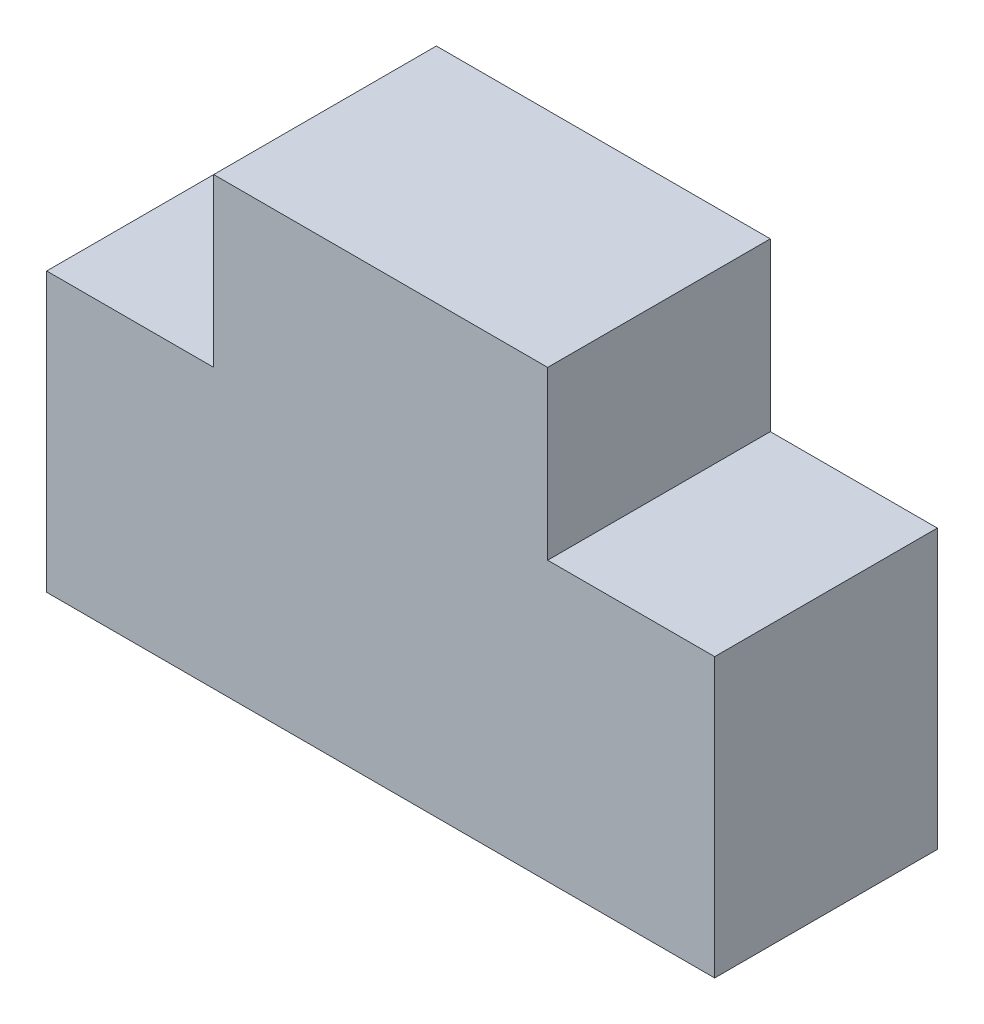
ISO-10303-21;
HEADER;
FILE_DESCRIPTION(('STEP AP214'),'2;1');
FILE_NAME('part.step','',(''),(''),'','','');
FILE_SCHEMA(('AUTOMOTIVE_DESIGN { 1 0 10303 214 1 1 1 1 }'));
ENDSEC;
DATA;
#1=APPLICATION_CONTEXT('core data for automotive mechanical design processes');
#2=APPLICATION_PROTOCOL_DEFINITION('international standard','automotive_design',2000,#1);
#3=PRODUCT_CONTEXT('',#1,'mechanical');
#4=PRODUCT('Part','Part','',(#3));
#5=PRODUCT_RELATED_PRODUCT_CATEGORY('part','',(#4));
#6=PRODUCT_DEFINITION_FORMATION('','',#4);
#7=PRODUCT_DEFINITION_CONTEXT('part definition',#1,'design');
#8=PRODUCT_DEFINITION('design','',#6,#7);
#9=PRODUCT_DEFINITION_SHAPE('','',#8);
#10=(LENGTH_UNIT() NAMED_UNIT(*) SI_UNIT(.MILLI.,.METRE.));
#11=(NAMED_UNIT(*) PLANE_ANGLE_UNIT() SI_UNIT($,.RADIAN.));
#12=(NAMED_UNIT(*) SI_UNIT($,.STERADIAN.) SOLID_ANGLE_UNIT());
#13=UNCERTAINTY_MEASURE_WITH_UNIT(LENGTH_MEASURE(1.E-05),#10,'distance_accuracy_value','');
#14=(GEOMETRIC_REPRESENTATION_CONTEXT(3) GLOBAL_UNCERTAINTY_ASSIGNED_CONTEXT((#13)) GLOBAL_UNIT_ASSIGNED_CONTEXT((#10,
#11,#12)) REPRESENTATION_CONTEXT('',''));
#15=CARTESIAN_POINT('',(0.,0.,0.));
#16=DIRECTION('',(0.,0.,1.));
#17=DIRECTION('',(1.,0.,0.));
#18=AXIS2_PLACEMENT_3D('',#15,#16,#17);
#19=CARTESIAN_POINT('',(38.1,25.4,12.7));
#20=DIRECTION('',(-1.,0.,0.));
#21=DIRECTION('',(0.,0.,1.));
#22=AXIS2_PLACEMENT_3D('',#19,#20,#21);
#23=PLANE('',#22);
#24=DIRECTION('',(0.,0.,1.));
#25=VECTOR('',#24,1.);
#26=CARTESIAN_POINT('',(38.1,6.35,-12.7));
#27=LINE('',#26,#25);
#28=CARTESIAN_POINT('',(38.1,6.35,-12.7));
#29=VERTEX_POINT('',#28);
#30=CARTESIAN_POINT('',(38.1,6.35,12.7));
#31=VERTEX_POINT('',#30);
#32=EDGE_CURVE('E148',#29,#31,#27,.T.);
#33=ORIENTED_EDGE('',*,*,#32,.T.);
#34=DIRECTION('',(0.,1.,0.));
#35=VECTOR('',#34,1.);
#36=CARTESIAN_POINT('',(38.1,25.4,12.7));
#37=LINE('',#36,#35);
#38=CARTESIAN_POINT('',(38.1,-25.4,12.7));
#39=VERTEX_POINT('',#38);
#40=EDGE_CURVE('E130',#39,#31,#37,.T.);
#41=ORIENTED_EDGE('',*,*,#40,.F.);
#42=DIRECTION('',(0.,0.,-1.));
#43=VECTOR('',#42,1.);
#44=CARTESIAN_POINT('',(38.1,-25.4,12.7));
#45=LINE('',#44,#43);
#46=CARTESIAN_POINT('',(38.1,-25.4,-12.7));
#47=VERTEX_POINT('',#46);
#48=EDGE_CURVE('E40',#39,#47,#45,.T.);
#49=ORIENTED_EDGE('',*,*,#48,.T.);
#50=DIRECTION('',(0.,1.,0.));
#51=VECTOR('',#50,1.);
#52=CARTESIAN_POINT('',(38.1,25.4,-12.7));
#53=LINE('',#52,#51);
#54=EDGE_CURVE('E117',#47,#29,#53,.T.);
#55=ORIENTED_EDGE('',*,*,#54,.T.);
#56=EDGE_LOOP('',(#33,#41,#49,#55));
#57=FACE_BOUND('',#56,.T.);
#58=ADVANCED_FACE('F32',(#57),#23,.F.);
#59=CARTESIAN_POINT('',(-38.1,25.4,12.7));
#60=DIRECTION('',(0.,-1.,0.));
#61=DIRECTION('',(0.,0.,-1.));
#62=AXIS2_PLACEMENT_3D('',#59,#60,#61);
#63=PLANE('',#62);
#64=DIRECTION('',(0.,0.,1.));
#65=VECTOR('',#64,1.);
#66=CARTESIAN_POINT('',(19.05,25.4,-12.7));
#67=LINE('',#66,#65);
#68=CARTESIAN_POINT('',(19.05,25.4,-12.7));
#69=VERTEX_POINT('',#68);
#70=CARTESIAN_POINT('',(19.05,25.4,12.7));
#71=VERTEX_POINT('',#70);
#72=EDGE_CURVE('E99',#69,#71,#67,.T.);
#73=ORIENTED_EDGE('',*,*,#72,.F.);
#74=DIRECTION('',(-1.,0.,0.));
#75=VECTOR('',#74,1.);
#76=CARTESIAN_POINT('',(-38.1,25.4,-12.7));
#77=LINE('',#76,#75);
#78=CARTESIAN_POINT('',(-19.05,25.4,-12.7));
#79=VERTEX_POINT('',#78);
#80=EDGE_CURVE('E111',#69,#79,#77,.T.);
#81=ORIENTED_EDGE('',*,*,#80,.T.);
#82=DIRECTION('',(0.,0.,1.));
#83=VECTOR('',#82,1.);
#84=CARTESIAN_POINT('',(-19.05,25.4,-12.7));
#85=LINE('',#84,#83);
#86=CARTESIAN_POINT('',(-19.05,25.4,12.7));
#87=VERTEX_POINT('',#86);
#88=EDGE_CURVE('E140',#79,#87,#85,.T.);
#89=ORIENTED_EDGE('',*,*,#88,.T.);
#90=DIRECTION('',(-1.,0.,0.));
#91=VECTOR('',#90,1.);
#92=CARTESIAN_POINT('',(-38.1,25.4,12.7));
#93=LINE('',#92,#91);
#94=EDGE_CURVE('E112',#71,#87,#93,.T.);
#95=ORIENTED_EDGE('',*,*,#94,.F.);
#96=EDGE_LOOP('',(#73,#81,#89,#95));
#97=FACE_BOUND('',#96,.T.);
#98=ADVANCED_FACE('F109',(#97),#63,.F.);
#99=CARTESIAN_POINT('',(0.,0.,12.7));
#100=DIRECTION('',(0.,0.,1.));
#101=DIRECTION('',(1.,0.,0.));
#102=AXIS2_PLACEMENT_3D('',#99,#100,#101);
#103=PLANE('',#102);
#104=ORIENTED_EDGE('',*,*,#40,.T.);
#105=DIRECTION('',(-1.,0.,0.));
#106=VECTOR('',#105,1.);
#107=CARTESIAN_POINT('',(38.1,6.35,12.7));
#108=LINE('',#107,#106);
#109=CARTESIAN_POINT('',(19.05,6.35,12.7));
#110=VERTEX_POINT('',#109);
#111=EDGE_CURVE('E105',#31,#110,#108,.T.);
#112=ORIENTED_EDGE('',*,*,#111,.T.);
#113=DIRECTION('',(0.,1.,0.));
#114=VECTOR('',#113,1.);
#115=CARTESIAN_POINT('',(19.05,25.4,12.7));
#116=LINE('',#115,#114);
#117=EDGE_CURVE('E171',#110,#71,#116,.T.);
#118=ORIENTED_EDGE('',*,*,#117,.T.);
#119=ORIENTED_EDGE('',*,*,#94,.T.);
#120=DIRECTION('',(0.,1.,0.));
#121=VECTOR('',#120,1.);
#122=CARTESIAN_POINT('',(-19.05,25.4,12.7));
#123=LINE('',#122,#121);
#124=CARTESIAN_POINT('',(-19.05,6.35,12.7));
#125=VERTEX_POINT('',#124);
#126=EDGE_CURVE('E162',#125,#87,#123,.T.);
#127=ORIENTED_EDGE('',*,*,#126,.F.);
#128=DIRECTION('',(1.,0.,0.));
#129=VECTOR('',#128,1.);
#130=CARTESIAN_POINT('',(-38.1,6.35,12.7));
#131=LINE('',#130,#129);
#132=CARTESIAN_POINT('',(-38.1,6.35,12.7));
#133=VERTEX_POINT('',#132);
#134=EDGE_CURVE('E150',#133,#125,#131,.T.);
#135=ORIENTED_EDGE('',*,*,#134,.F.);
#136=DIRECTION('',(0.,-1.,0.));
#137=VECTOR('',#136,1.);
#138=CARTESIAN_POINT('',(-38.1,25.4,12.7));
#139=LINE('',#138,#137);
#140=CARTESIAN_POINT('',(-38.1,-25.4,12.7));
#141=VERTEX_POINT('',#140);
#142=EDGE_CURVE('E116',#133,#141,#139,.T.);
#143=ORIENTED_EDGE('',*,*,#142,.T.);
#144=DIRECTION('',(1.,0.,0.));
#145=VECTOR('',#144,1.);
#146=CARTESIAN_POINT('',(-38.1,-25.4,12.7));
#147=LINE('',#146,#145);
#148=EDGE_CURVE('E119',#141,#39,#147,.T.);
#149=ORIENTED_EDGE('',*,*,#148,.T.);
#150=EDGE_LOOP('',(#104,#112,#118,#119,#127,#135,#143,#149));
#151=FACE_BOUND('',#150,.T.);
#152=ADVANCED_FACE('F153',(#151),#103,.T.);
#153=CARTESIAN_POINT('',(0.,0.,-12.7));
#154=DIRECTION('',(0.,0.,1.));
#155=DIRECTION('',(1.,0.,0.));
#156=AXIS2_PLACEMENT_3D('',#153,#154,#155);
#157=PLANE('',#156);
#158=DIRECTION('',(-1.,0.,0.));
#159=VECTOR('',#158,1.);
#160=CARTESIAN_POINT('',(38.1,6.35,-12.7));
#161=LINE('',#160,#159);
#162=CARTESIAN_POINT('',(19.05,6.35,-12.7));
#163=VERTEX_POINT('',#162);
#164=EDGE_CURVE('E104',#29,#163,#161,.T.);
#165=ORIENTED_EDGE('',*,*,#164,.F.);
#166=ORIENTED_EDGE('',*,*,#54,.F.);
#167=DIRECTION('',(1.,0.,0.));
#168=VECTOR('',#167,1.);
#169=CARTESIAN_POINT('',(-38.1,-25.4,-12.7));
#170=LINE('',#169,#168);
#171=CARTESIAN_POINT('',(-38.1,-25.4,-12.7));
#172=VERTEX_POINT('',#171);
#173=EDGE_CURVE('E122',#172,#47,#170,.T.);
#174=ORIENTED_EDGE('',*,*,#173,.F.);
#175=DIRECTION('',(0.,-1.,0.));
#176=VECTOR('',#175,1.);
#177=CARTESIAN_POINT('',(-38.1,25.4,-12.7));
#178=LINE('',#177,#176);
#179=CARTESIAN_POINT('',(-38.1,6.35,-12.7));
#180=VERTEX_POINT('',#179);
#181=EDGE_CURVE('E139',#180,#172,#178,.T.);
#182=ORIENTED_EDGE('',*,*,#181,.F.);
#183=DIRECTION('',(1.,0.,0.));
#184=VECTOR('',#183,1.);
#185=CARTESIAN_POINT('',(-38.1,6.35,-12.7));
#186=LINE('',#185,#184);
#187=CARTESIAN_POINT('',(-19.05,6.35,-12.7));
#188=VERTEX_POINT('',#187);
#189=EDGE_CURVE('E164',#180,#188,#186,.T.);
#190=ORIENTED_EDGE('',*,*,#189,.T.);
#191=DIRECTION('',(0.,1.,0.));
#192=VECTOR('',#191,1.);
#193=CARTESIAN_POINT('',(-19.05,25.4,-12.7));
#194=LINE('',#193,#192);
#195=EDGE_CURVE('E55',#188,#79,#194,.T.);
#196=ORIENTED_EDGE('',*,*,#195,.T.);
#197=ORIENTED_EDGE('',*,*,#80,.F.);
#198=DIRECTION('',(0.,1.,0.));
#199=VECTOR('',#198,1.);
#200=CARTESIAN_POINT('',(19.05,25.4,-12.7));
#201=LINE('',#200,#199);
#202=EDGE_CURVE('E96',#163,#69,#201,.T.);
#203=ORIENTED_EDGE('',*,*,#202,.F.);
#204=EDGE_LOOP('',(#165,#166,#174,#182,#190,#196,#197,#203));
#205=FACE_BOUND('',#204,.T.);
#206=ADVANCED_FACE('F114',(#205),#157,.F.);
#207=CARTESIAN_POINT('',(-38.1,25.4,12.7));
#208=DIRECTION('',(1.,0.,0.));
#209=DIRECTION('',(0.,1.,0.));
#210=AXIS2_PLACEMENT_3D('',#207,#208,#209);
#211=PLANE('',#210);
#212=ORIENTED_EDGE('',*,*,#142,.F.);
#213=DIRECTION('',(0.,0.,1.));
#214=VECTOR('',#213,1.);
#215=CARTESIAN_POINT('',(-38.1,6.35,-12.7));
#216=LINE('',#215,#214);
#217=EDGE_CURVE('E157',#180,#133,#216,.T.);
#218=ORIENTED_EDGE('',*,*,#217,.F.);
#219=ORIENTED_EDGE('',*,*,#181,.T.);
#220=DIRECTION('',(0.,0.,-1.));
#221=VECTOR('',#220,1.);
#222=CARTESIAN_POINT('',(-38.1,-25.4,12.7));
#223=LINE('',#222,#221);
#224=EDGE_CURVE('E11',#141,#172,#223,.T.);
#225=ORIENTED_EDGE('',*,*,#224,.F.);
#226=EDGE_LOOP('',(#212,#218,#219,#225));
#227=FACE_BOUND('',#226,.T.);
#228=ADVANCED_FACE('F34',(#227),#211,.F.);
#229=CARTESIAN_POINT('',(-38.1,-25.4,12.7));
#230=DIRECTION('',(0.,1.,0.));
#231=DIRECTION('',(0.,0.,1.));
#232=AXIS2_PLACEMENT_3D('',#229,#230,#231);
#233=PLANE('',#232);
#234=ORIENTED_EDGE('',*,*,#173,.T.);
#235=ORIENTED_EDGE('',*,*,#48,.F.);
#236=ORIENTED_EDGE('',*,*,#148,.F.);
#237=ORIENTED_EDGE('',*,*,#224,.T.);
#238=EDGE_LOOP('',(#234,#235,#236,#237));
#239=FACE_BOUND('',#238,.T.);
#240=ADVANCED_FACE('F143',(#239),#233,.F.);
#241=CARTESIAN_POINT('',(-19.05,25.4,-12.7));
#242=DIRECTION('',(1.,0.,0.));
#243=DIRECTION('',(0.,1.,0.));
#244=AXIS2_PLACEMENT_3D('',#241,#242,#243);
#245=PLANE('',#244);
#246=ORIENTED_EDGE('',*,*,#126,.T.);
#247=ORIENTED_EDGE('',*,*,#88,.F.);
#248=ORIENTED_EDGE('',*,*,#195,.F.);
#249=DIRECTION('',(0.,0.,1.));
#250=VECTOR('',#249,1.);
#251=CARTESIAN_POINT('',(-19.05,6.35,-12.7));
#252=LINE('',#251,#250);
#253=EDGE_CURVE('E159',#188,#125,#252,.T.);
#254=ORIENTED_EDGE('',*,*,#253,.T.);
#255=EDGE_LOOP('',(#246,#247,#248,#254));
#256=FACE_BOUND('',#255,.T.);
#257=ADVANCED_FACE('F182',(#256),#245,.F.);
#258=CARTESIAN_POINT('',(-38.1,6.35,-12.7));
#259=DIRECTION('',(0.,-1.,0.));
#260=DIRECTION('',(0.,0.,-1.));
#261=AXIS2_PLACEMENT_3D('',#258,#259,#260);
#262=PLANE('',#261);
#263=ORIENTED_EDGE('',*,*,#134,.T.);
#264=ORIENTED_EDGE('',*,*,#253,.F.);
#265=ORIENTED_EDGE('',*,*,#189,.F.);
#266=ORIENTED_EDGE('',*,*,#217,.T.);
#267=EDGE_LOOP('',(#263,#264,#265,#266));
#268=FACE_BOUND('',#267,.T.);
#269=ADVANCED_FACE('F175',(#268),#262,.F.);
#270=CARTESIAN_POINT('',(38.1,6.35,-12.7));
#271=DIRECTION('',(0.,1.,0.));
#272=DIRECTION('',(0.,0.,1.));
#273=AXIS2_PLACEMENT_3D('',#270,#271,#272);
#274=PLANE('',#273);
#275=ORIENTED_EDGE('',*,*,#111,.F.);
#276=ORIENTED_EDGE('',*,*,#32,.F.);
#277=ORIENTED_EDGE('',*,*,#164,.T.);
#278=DIRECTION('',(0.,0.,1.));
#279=VECTOR('',#278,1.);
#280=CARTESIAN_POINT('',(19.05,6.35,-12.7));
#281=LINE('',#280,#279);
#282=EDGE_CURVE('E47',#163,#110,#281,.T.);
#283=ORIENTED_EDGE('',*,*,#282,.T.);
#284=EDGE_LOOP('',(#275,#276,#277,#283));
#285=FACE_BOUND('',#284,.T.);
#286=ADVANCED_FACE('F173',(#285),#274,.T.);
#287=CARTESIAN_POINT('',(19.05,25.4,-12.7));
#288=DIRECTION('',(1.,0.,0.));
#289=DIRECTION('',(0.,1.,0.));
#290=AXIS2_PLACEMENT_3D('',#287,#288,#289);
#291=PLANE('',#290);
#292=ORIENTED_EDGE('',*,*,#117,.F.);
#293=ORIENTED_EDGE('',*,*,#282,.F.);
#294=ORIENTED_EDGE('',*,*,#202,.T.);
#295=ORIENTED_EDGE('',*,*,#72,.T.);
#296=EDGE_LOOP('',(#292,#293,#294,#295));
#297=FACE_BOUND('',#296,.T.);
#298=ADVANCED_FACE('F98',(#297),#291,.T.);
#299=CLOSED_SHELL('',(#58,#98,#152,#206,#228,#240,#257,#269,#286,#298));
#300=MANIFOLD_SOLID_BREP('B2',#299);
#301=ADVANCED_BREP_SHAPE_REPRESENTATION('',(#18,#300),#14);
#302=SHAPE_DEFINITION_REPRESENTATION(#9,#301);
ENDSEC;
END-ISO-10303-21;
